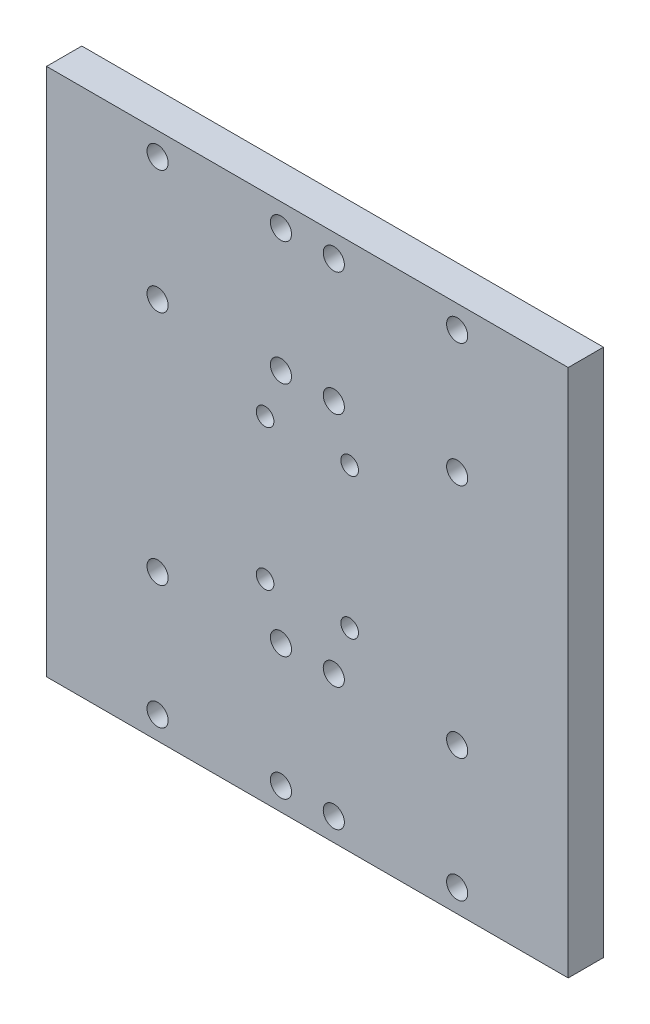
ISO-10303-21;
HEADER;
FILE_DESCRIPTION(('STEP AP214'),'2;1');
FILE_NAME('part.step','',(''),(''),'','','');
FILE_SCHEMA(('AUTOMOTIVE_DESIGN { 1 0 10303 214 1 1 1 1 }'));
ENDSEC;
DATA;
#1=APPLICATION_CONTEXT('core data for automotive mechanical design processes');
#2=APPLICATION_PROTOCOL_DEFINITION('international standard','automotive_design',2000,#1);
#3=PRODUCT_CONTEXT('',#1,'mechanical');
#4=PRODUCT('Part','Part','',(#3));
#5=PRODUCT_RELATED_PRODUCT_CATEGORY('part','',(#4));
#6=PRODUCT_DEFINITION_FORMATION('','',#4);
#7=PRODUCT_DEFINITION_CONTEXT('part definition',#1,'design');
#8=PRODUCT_DEFINITION('design','',#6,#7);
#9=PRODUCT_DEFINITION_SHAPE('','',#8);
#10=(LENGTH_UNIT() NAMED_UNIT(*) SI_UNIT(.MILLI.,.METRE.));
#11=(NAMED_UNIT(*) PLANE_ANGLE_UNIT() SI_UNIT($,.RADIAN.));
#12=(NAMED_UNIT(*) SI_UNIT($,.STERADIAN.) SOLID_ANGLE_UNIT());
#13=UNCERTAINTY_MEASURE_WITH_UNIT(LENGTH_MEASURE(1.E-05),#10,'distance_accuracy_value','');
#14=(GEOMETRIC_REPRESENTATION_CONTEXT(3) GLOBAL_UNCERTAINTY_ASSIGNED_CONTEXT((#13)) GLOBAL_UNIT_ASSIGNED_CONTEXT((#10,
#11,#12)) REPRESENTATION_CONTEXT('',''));
#15=CARTESIAN_POINT('',(0.,0.,0.));
#16=DIRECTION('',(0.,0.,1.));
#17=DIRECTION('',(1.,0.,0.));
#18=AXIS2_PLACEMENT_3D('',#15,#16,#17);
#19=CARTESIAN_POINT('',(-74.,-75.,10.));
#20=DIRECTION('',(1.,0.,0.));
#21=DIRECTION('',(0.,0.,-1.));
#22=AXIS2_PLACEMENT_3D('',#19,#20,#21);
#23=PLANE('',#22);
#24=DIRECTION('',(0.,-1.,0.));
#25=VECTOR('',#24,1.);
#26=CARTESIAN_POINT('',(-74.,-75.,0.));
#27=LINE('',#26,#25);
#28=CARTESIAN_POINT('',(-74.,75.,0.));
#29=VERTEX_POINT('',#28);
#30=CARTESIAN_POINT('',(-74.,-75.,0.));
#31=VERTEX_POINT('',#30);
#32=EDGE_CURVE('E95',#29,#31,#27,.T.);
#33=ORIENTED_EDGE('',*,*,#32,.T.);
#34=DIRECTION('',(0.,0.,-1.));
#35=VECTOR('',#34,1.);
#36=CARTESIAN_POINT('',(-74.,-75.,10.));
#37=LINE('',#36,#35);
#38=CARTESIAN_POINT('',(-74.,-75.,10.));
#39=VERTEX_POINT('',#38);
#40=EDGE_CURVE('E11',#39,#31,#37,.T.);
#41=ORIENTED_EDGE('',*,*,#40,.F.);
#42=DIRECTION('',(0.,-1.,0.));
#43=VECTOR('',#42,1.);
#44=CARTESIAN_POINT('',(-74.,-75.,10.));
#45=LINE('',#44,#43);
#46=CARTESIAN_POINT('',(-74.,75.,10.));
#47=VERTEX_POINT('',#46);
#48=EDGE_CURVE('E83',#47,#39,#45,.T.);
#49=ORIENTED_EDGE('',*,*,#48,.F.);
#50=DIRECTION('',(0.,0.,-1.));
#51=VECTOR('',#50,1.);
#52=CARTESIAN_POINT('',(-74.,75.,10.));
#53=LINE('',#52,#51);
#54=EDGE_CURVE('E91',#47,#29,#53,.T.);
#55=ORIENTED_EDGE('',*,*,#54,.T.);
#56=EDGE_LOOP('',(#33,#41,#49,#55));
#57=FACE_BOUND('',#56,.T.);
#58=ADVANCED_FACE('F32',(#57),#23,.F.);
#59=CARTESIAN_POINT('',(74.,-75.,10.));
#60=DIRECTION('',(0.,1.,0.));
#61=DIRECTION('',(0.,0.,1.));
#62=AXIS2_PLACEMENT_3D('',#59,#60,#61);
#63=PLANE('',#62);
#64=DIRECTION('',(1.,0.,0.));
#65=VECTOR('',#64,1.);
#66=CARTESIAN_POINT('',(74.,-75.,0.));
#67=LINE('',#66,#65);
#68=CARTESIAN_POINT('',(74.,-75.,0.));
#69=VERTEX_POINT('',#68);
#70=EDGE_CURVE('E87',#31,#69,#67,.T.);
#71=ORIENTED_EDGE('',*,*,#70,.T.);
#72=DIRECTION('',(0.,0.,-1.));
#73=VECTOR('',#72,1.);
#74=CARTESIAN_POINT('',(74.,-75.,10.));
#75=LINE('',#74,#73);
#76=CARTESIAN_POINT('',(74.,-75.,10.));
#77=VERTEX_POINT('',#76);
#78=EDGE_CURVE('E40',#77,#69,#75,.T.);
#79=ORIENTED_EDGE('',*,*,#78,.F.);
#80=DIRECTION('',(1.,0.,0.));
#81=VECTOR('',#80,1.);
#82=CARTESIAN_POINT('',(74.,-75.,10.));
#83=LINE('',#82,#81);
#84=EDGE_CURVE('E78',#39,#77,#83,.T.);
#85=ORIENTED_EDGE('',*,*,#84,.F.);
#86=ORIENTED_EDGE('',*,*,#40,.T.);
#87=EDGE_LOOP('',(#71,#79,#85,#86));
#88=FACE_BOUND('',#87,.T.);
#89=ADVANCED_FACE('F86',(#88),#63,.F.);
#90=CARTESIAN_POINT('',(74.,-75.,10.));
#91=DIRECTION('',(-1.,0.,0.));
#92=DIRECTION('',(0.,0.,1.));
#93=AXIS2_PLACEMENT_3D('',#90,#91,#92);
#94=PLANE('',#93);
#95=DIRECTION('',(0.,1.,0.));
#96=VECTOR('',#95,1.);
#97=CARTESIAN_POINT('',(74.,-75.,0.));
#98=LINE('',#97,#96);
#99=CARTESIAN_POINT('',(74.,75.,0.));
#100=VERTEX_POINT('',#99);
#101=EDGE_CURVE('E65',#69,#100,#98,.T.);
#102=ORIENTED_EDGE('',*,*,#101,.T.);
#103=DIRECTION('',(0.,0.,-1.));
#104=VECTOR('',#103,1.);
#105=CARTESIAN_POINT('',(74.,75.,10.));
#106=LINE('',#105,#104);
#107=CARTESIAN_POINT('',(74.,75.,10.));
#108=VERTEX_POINT('',#107);
#109=EDGE_CURVE('E88',#108,#100,#106,.T.);
#110=ORIENTED_EDGE('',*,*,#109,.F.);
#111=DIRECTION('',(0.,1.,0.));
#112=VECTOR('',#111,1.);
#113=CARTESIAN_POINT('',(74.,-75.,10.));
#114=LINE('',#113,#112);
#115=EDGE_CURVE('E81',#77,#108,#114,.T.);
#116=ORIENTED_EDGE('',*,*,#115,.F.);
#117=ORIENTED_EDGE('',*,*,#78,.T.);
#118=EDGE_LOOP('',(#102,#110,#116,#117));
#119=FACE_BOUND('',#118,.T.);
#120=ADVANCED_FACE('F89',(#119),#94,.F.);
#121=CARTESIAN_POINT('',(74.,75.,10.));
#122=DIRECTION('',(0.,-1.,0.));
#123=DIRECTION('',(0.,0.,-1.));
#124=AXIS2_PLACEMENT_3D('',#121,#122,#123);
#125=PLANE('',#124);
#126=DIRECTION('',(-1.,0.,0.));
#127=VECTOR('',#126,1.);
#128=CARTESIAN_POINT('',(74.,75.,0.));
#129=LINE('',#128,#127);
#130=EDGE_CURVE('E71',#100,#29,#129,.T.);
#131=ORIENTED_EDGE('',*,*,#130,.T.);
#132=ORIENTED_EDGE('',*,*,#54,.F.);
#133=DIRECTION('',(-1.,0.,0.));
#134=VECTOR('',#133,1.);
#135=CARTESIAN_POINT('',(74.,75.,10.));
#136=LINE('',#135,#134);
#137=EDGE_CURVE('E48',#108,#47,#136,.T.);
#138=ORIENTED_EDGE('',*,*,#137,.F.);
#139=ORIENTED_EDGE('',*,*,#109,.T.);
#140=EDGE_LOOP('',(#131,#132,#138,#139));
#141=FACE_BOUND('',#140,.T.);
#142=ADVANCED_FACE('F103',(#141),#125,.F.);
#143=CARTESIAN_POINT('',(0.,0.,10.));
#144=DIRECTION('',(0.,0.,1.));
#145=DIRECTION('',(1.,0.,0.));
#146=AXIS2_PLACEMENT_3D('',#143,#144,#145);
#147=PLANE('',#146);
#148=CARTESIAN_POINT('',(-42.5,-68.5,10.));
#149=DIRECTION('',(0.,0.,1.));
#150=DIRECTION('',(-1.,0.,0.));
#151=AXIS2_PLACEMENT_3D('',#148,#149,#150);
#152=CIRCLE('',#151,3.);
#153=CARTESIAN_POINT('',(-45.5,-68.5,10.));
#154=VERTEX_POINT('',#153);
#155=EDGE_CURVE('E223',#154,#154,#152,.T.);
#156=ORIENTED_EDGE('',*,*,#155,.F.);
#157=EDGE_LOOP('',(#156));
#158=FACE_BOUND('',#157,.T.);
#159=CARTESIAN_POINT('',(-42.5,-33.5,10.));
#160=DIRECTION('',(0.,0.,1.));
#161=DIRECTION('',(-1.,0.,0.));
#162=AXIS2_PLACEMENT_3D('',#159,#160,#161);
#163=CIRCLE('',#162,3.);
#164=CARTESIAN_POINT('',(-45.5,-33.5,10.));
#165=VERTEX_POINT('',#164);
#166=EDGE_CURVE('E217',#165,#165,#163,.T.);
#167=ORIENTED_EDGE('',*,*,#166,.F.);
#168=EDGE_LOOP('',(#167));
#169=FACE_BOUND('',#168,.T.);
#170=CARTESIAN_POINT('',(42.5,-33.5,10.));
#171=DIRECTION('',(0.,0.,1.));
#172=DIRECTION('',(-1.,0.,0.));
#173=AXIS2_PLACEMENT_3D('',#170,#171,#172);
#174=CIRCLE('',#173,3.);
#175=CARTESIAN_POINT('',(39.5,-33.5,10.));
#176=VERTEX_POINT('',#175);
#177=EDGE_CURVE('E211',#176,#176,#174,.T.);
#178=ORIENTED_EDGE('',*,*,#177,.F.);
#179=EDGE_LOOP('',(#178));
#180=FACE_BOUND('',#179,.T.);
#181=CARTESIAN_POINT('',(42.5,-68.5,10.));
#182=DIRECTION('',(0.,0.,1.));
#183=DIRECTION('',(-1.,0.,0.));
#184=AXIS2_PLACEMENT_3D('',#181,#182,#183);
#185=CIRCLE('',#184,3.);
#186=CARTESIAN_POINT('',(39.5,-68.5,10.));
#187=VERTEX_POINT('',#186);
#188=EDGE_CURVE('E205',#187,#187,#185,.T.);
#189=ORIENTED_EDGE('',*,*,#188,.F.);
#190=EDGE_LOOP('',(#189));
#191=FACE_BOUND('',#190,.T.);
#192=CARTESIAN_POINT('',(-7.49999999999998,-68.5,10.));
#193=DIRECTION('',(0.,0.,1.));
#194=DIRECTION('',(-1.,0.,0.));
#195=AXIS2_PLACEMENT_3D('',#192,#193,#194);
#196=CIRCLE('',#195,3.);
#197=CARTESIAN_POINT('',(-10.5,-68.5,10.));
#198=VERTEX_POINT('',#197);
#199=EDGE_CURVE('E199',#198,#198,#196,.T.);
#200=ORIENTED_EDGE('',*,*,#199,.F.);
#201=EDGE_LOOP('',(#200));
#202=FACE_BOUND('',#201,.T.);
#203=CARTESIAN_POINT('',(7.50000000000002,-68.5,10.));
#204=DIRECTION('',(0.,0.,1.));
#205=DIRECTION('',(-1.,0.,0.));
#206=AXIS2_PLACEMENT_3D('',#203,#204,#205);
#207=CIRCLE('',#206,3.);
#208=CARTESIAN_POINT('',(4.50000000000001,-68.5,10.));
#209=VERTEX_POINT('',#208);
#210=EDGE_CURVE('E193',#209,#209,#207,.T.);
#211=ORIENTED_EDGE('',*,*,#210,.F.);
#212=EDGE_LOOP('',(#211));
#213=FACE_BOUND('',#212,.T.);
#214=CARTESIAN_POINT('',(-7.49999999999999,-33.5,10.));
#215=DIRECTION('',(0.,0.,1.));
#216=DIRECTION('',(-1.,0.,0.));
#217=AXIS2_PLACEMENT_3D('',#214,#215,#216);
#218=CIRCLE('',#217,3.);
#219=CARTESIAN_POINT('',(-10.5,-33.5,10.));
#220=VERTEX_POINT('',#219);
#221=EDGE_CURVE('E187',#220,#220,#218,.T.);
#222=ORIENTED_EDGE('',*,*,#221,.F.);
#223=EDGE_LOOP('',(#222));
#224=FACE_BOUND('',#223,.T.);
#225=CARTESIAN_POINT('',(7.50000000000001,-33.5,10.));
#226=DIRECTION('',(0.,0.,1.));
#227=DIRECTION('',(-1.,0.,0.));
#228=AXIS2_PLACEMENT_3D('',#225,#226,#227);
#229=CIRCLE('',#228,3.);
#230=CARTESIAN_POINT('',(4.5,-33.5,10.));
#231=VERTEX_POINT('',#230);
#232=EDGE_CURVE('E181',#231,#231,#229,.T.);
#233=ORIENTED_EDGE('',*,*,#232,.F.);
#234=EDGE_LOOP('',(#233));
#235=FACE_BOUND('',#234,.T.);
#236=CARTESIAN_POINT('',(-12.,-20.,10.));
#237=DIRECTION('',(0.,0.,1.));
#238=DIRECTION('',(-1.,0.,0.));
#239=AXIS2_PLACEMENT_3D('',#236,#237,#238);
#240=CIRCLE('',#239,2.5);
#241=CARTESIAN_POINT('',(-14.5,-20.,10.));
#242=VERTEX_POINT('',#241);
#243=EDGE_CURVE('E175',#242,#242,#240,.T.);
#244=ORIENTED_EDGE('',*,*,#243,.F.);
#245=EDGE_LOOP('',(#244));
#246=FACE_BOUND('',#245,.T.);
#247=CARTESIAN_POINT('',(12.,-20.,10.));
#248=DIRECTION('',(0.,0.,1.));
#249=DIRECTION('',(-1.,0.,0.));
#250=AXIS2_PLACEMENT_3D('',#247,#248,#249);
#251=CIRCLE('',#250,2.5);
#252=CARTESIAN_POINT('',(9.5,-20.,10.));
#253=VERTEX_POINT('',#252);
#254=EDGE_CURVE('E169',#253,#253,#251,.T.);
#255=ORIENTED_EDGE('',*,*,#254,.F.);
#256=EDGE_LOOP('',(#255));
#257=FACE_BOUND('',#256,.T.);
#258=CARTESIAN_POINT('',(12.,20.,10.));
#259=DIRECTION('',(0.,0.,1.));
#260=DIRECTION('',(1.,0.,0.));
#261=AXIS2_PLACEMENT_3D('',#258,#259,#260);
#262=CIRCLE('',#261,2.5);
#263=CARTESIAN_POINT('',(14.5,20.,10.));
#264=VERTEX_POINT('',#263);
#265=EDGE_CURVE('E163',#264,#264,#262,.T.);
#266=ORIENTED_EDGE('',*,*,#265,.F.);
#267=EDGE_LOOP('',(#266));
#268=FACE_BOUND('',#267,.T.);
#269=CARTESIAN_POINT('',(-12.,20.,10.));
#270=DIRECTION('',(0.,0.,1.));
#271=DIRECTION('',(1.,0.,0.));
#272=AXIS2_PLACEMENT_3D('',#269,#270,#271);
#273=CIRCLE('',#272,2.5);
#274=CARTESIAN_POINT('',(-9.5,20.,10.));
#275=VERTEX_POINT('',#274);
#276=EDGE_CURVE('E157',#275,#275,#273,.T.);
#277=ORIENTED_EDGE('',*,*,#276,.F.);
#278=EDGE_LOOP('',(#277));
#279=FACE_BOUND('',#278,.T.);
#280=CARTESIAN_POINT('',(7.5,33.5,10.));
#281=DIRECTION('',(0.,0.,1.));
#282=DIRECTION('',(1.,0.,0.));
#283=AXIS2_PLACEMENT_3D('',#280,#281,#282);
#284=CIRCLE('',#283,3.);
#285=CARTESIAN_POINT('',(10.5,33.5,10.));
#286=VERTEX_POINT('',#285);
#287=EDGE_CURVE('E151',#286,#286,#284,.T.);
#288=ORIENTED_EDGE('',*,*,#287,.F.);
#289=EDGE_LOOP('',(#288));
#290=FACE_BOUND('',#289,.T.);
#291=CARTESIAN_POINT('',(-7.5,33.5,10.));
#292=DIRECTION('',(0.,0.,1.));
#293=DIRECTION('',(1.,0.,0.));
#294=AXIS2_PLACEMENT_3D('',#291,#292,#293);
#295=CIRCLE('',#294,3.);
#296=CARTESIAN_POINT('',(-4.5,33.5,10.));
#297=VERTEX_POINT('',#296);
#298=EDGE_CURVE('E145',#297,#297,#295,.T.);
#299=ORIENTED_EDGE('',*,*,#298,.F.);
#300=EDGE_LOOP('',(#299));
#301=FACE_BOUND('',#300,.T.);
#302=CARTESIAN_POINT('',(7.5,68.5,10.));
#303=DIRECTION('',(0.,0.,1.));
#304=DIRECTION('',(1.,0.,0.));
#305=AXIS2_PLACEMENT_3D('',#302,#303,#304);
#306=CIRCLE('',#305,3.);
#307=CARTESIAN_POINT('',(10.5,68.5,10.));
#308=VERTEX_POINT('',#307);
#309=EDGE_CURVE('E139',#308,#308,#306,.T.);
#310=ORIENTED_EDGE('',*,*,#309,.F.);
#311=EDGE_LOOP('',(#310));
#312=FACE_BOUND('',#311,.T.);
#313=CARTESIAN_POINT('',(-7.5,68.5,10.));
#314=DIRECTION('',(0.,0.,1.));
#315=DIRECTION('',(1.,0.,0.));
#316=AXIS2_PLACEMENT_3D('',#313,#314,#315);
#317=CIRCLE('',#316,3.);
#318=CARTESIAN_POINT('',(-4.5,68.5,10.));
#319=VERTEX_POINT('',#318);
#320=EDGE_CURVE('E133',#319,#319,#317,.T.);
#321=ORIENTED_EDGE('',*,*,#320,.F.);
#322=EDGE_LOOP('',(#321));
#323=FACE_BOUND('',#322,.T.);
#324=CARTESIAN_POINT('',(42.5,68.5,10.));
#325=DIRECTION('',(0.,0.,1.));
#326=DIRECTION('',(1.,0.,0.));
#327=AXIS2_PLACEMENT_3D('',#324,#325,#326);
#328=CIRCLE('',#327,3.);
#329=CARTESIAN_POINT('',(45.5,68.5,10.));
#330=VERTEX_POINT('',#329);
#331=EDGE_CURVE('E127',#330,#330,#328,.T.);
#332=ORIENTED_EDGE('',*,*,#331,.F.);
#333=EDGE_LOOP('',(#332));
#334=FACE_BOUND('',#333,.T.);
#335=CARTESIAN_POINT('',(42.5,33.5,10.));
#336=DIRECTION('',(0.,0.,1.));
#337=DIRECTION('',(1.,0.,0.));
#338=AXIS2_PLACEMENT_3D('',#335,#336,#337);
#339=CIRCLE('',#338,3.);
#340=CARTESIAN_POINT('',(45.5,33.5,10.));
#341=VERTEX_POINT('',#340);
#342=EDGE_CURVE('E121',#341,#341,#339,.T.);
#343=ORIENTED_EDGE('',*,*,#342,.F.);
#344=EDGE_LOOP('',(#343));
#345=FACE_BOUND('',#344,.T.);
#346=CARTESIAN_POINT('',(-42.5,33.5,10.));
#347=DIRECTION('',(0.,0.,1.));
#348=DIRECTION('',(1.,0.,0.));
#349=AXIS2_PLACEMENT_3D('',#346,#347,#348);
#350=CIRCLE('',#349,3.);
#351=CARTESIAN_POINT('',(-39.5,33.5,10.));
#352=VERTEX_POINT('',#351);
#353=EDGE_CURVE('E115',#352,#352,#350,.T.);
#354=ORIENTED_EDGE('',*,*,#353,.F.);
#355=EDGE_LOOP('',(#354));
#356=FACE_BOUND('',#355,.T.);
#357=CARTESIAN_POINT('',(-42.5,68.5,10.));
#358=DIRECTION('',(0.,0.,1.));
#359=DIRECTION('',(1.,0.,0.));
#360=AXIS2_PLACEMENT_3D('',#357,#358,#359);
#361=CIRCLE('',#360,3.);
#362=CARTESIAN_POINT('',(-39.5,68.5,10.));
#363=VERTEX_POINT('',#362);
#364=EDGE_CURVE('E109',#363,#363,#361,.T.);
#365=ORIENTED_EDGE('',*,*,#364,.F.);
#366=EDGE_LOOP('',(#365));
#367=FACE_BOUND('',#366,.T.);
#368=ORIENTED_EDGE('',*,*,#48,.T.);
#369=ORIENTED_EDGE('',*,*,#84,.T.);
#370=ORIENTED_EDGE('',*,*,#115,.T.);
#371=ORIENTED_EDGE('',*,*,#137,.T.);
#372=EDGE_LOOP('',(#368,#369,#370,#371));
#373=FACE_BOUND('',#372,.T.);
#374=ADVANCED_FACE('F79',(#158,#169,#180,#191,#202,#213,#224,#235,#246,#257,#268,#279,#290,#301,
#312,#323,#334,#345,#356,#367,#373),#147,.T.);
#375=CARTESIAN_POINT('',(0.,0.,0.));
#376=DIRECTION('',(0.,0.,1.));
#377=DIRECTION('',(1.,0.,0.));
#378=AXIS2_PLACEMENT_3D('',#375,#376,#377);
#379=PLANE('',#378);
#380=CARTESIAN_POINT('',(-42.5,-68.5,0.));
#381=DIRECTION('',(0.,0.,1.));
#382=DIRECTION('',(-1.,0.,0.));
#383=AXIS2_PLACEMENT_3D('',#380,#381,#382);
#384=CIRCLE('',#383,3.);
#385=CARTESIAN_POINT('',(-45.5,-68.5,0.));
#386=VERTEX_POINT('',#385);
#387=EDGE_CURVE('E220',#386,#386,#384,.T.);
#388=ORIENTED_EDGE('',*,*,#387,.T.);
#389=EDGE_LOOP('',(#388));
#390=FACE_BOUND('',#389,.T.);
#391=CARTESIAN_POINT('',(-42.5,-33.5,0.));
#392=DIRECTION('',(0.,0.,1.));
#393=DIRECTION('',(-1.,0.,0.));
#394=AXIS2_PLACEMENT_3D('',#391,#392,#393);
#395=CIRCLE('',#394,3.);
#396=CARTESIAN_POINT('',(-45.5,-33.5,0.));
#397=VERTEX_POINT('',#396);
#398=EDGE_CURVE('E214',#397,#397,#395,.T.);
#399=ORIENTED_EDGE('',*,*,#398,.T.);
#400=EDGE_LOOP('',(#399));
#401=FACE_BOUND('',#400,.T.);
#402=CARTESIAN_POINT('',(42.5,-33.5,0.));
#403=DIRECTION('',(0.,0.,1.));
#404=DIRECTION('',(-1.,0.,0.));
#405=AXIS2_PLACEMENT_3D('',#402,#403,#404);
#406=CIRCLE('',#405,3.);
#407=CARTESIAN_POINT('',(39.5,-33.5,0.));
#408=VERTEX_POINT('',#407);
#409=EDGE_CURVE('E208',#408,#408,#406,.T.);
#410=ORIENTED_EDGE('',*,*,#409,.T.);
#411=EDGE_LOOP('',(#410));
#412=FACE_BOUND('',#411,.T.);
#413=CARTESIAN_POINT('',(42.5,-68.5,0.));
#414=DIRECTION('',(0.,0.,1.));
#415=DIRECTION('',(-1.,0.,0.));
#416=AXIS2_PLACEMENT_3D('',#413,#414,#415);
#417=CIRCLE('',#416,3.);
#418=CARTESIAN_POINT('',(39.5,-68.5,0.));
#419=VERTEX_POINT('',#418);
#420=EDGE_CURVE('E202',#419,#419,#417,.T.);
#421=ORIENTED_EDGE('',*,*,#420,.T.);
#422=EDGE_LOOP('',(#421));
#423=FACE_BOUND('',#422,.T.);
#424=CARTESIAN_POINT('',(-7.49999999999998,-68.5,0.));
#425=DIRECTION('',(0.,0.,1.));
#426=DIRECTION('',(-1.,0.,0.));
#427=AXIS2_PLACEMENT_3D('',#424,#425,#426);
#428=CIRCLE('',#427,3.);
#429=CARTESIAN_POINT('',(-10.5,-68.5,0.));
#430=VERTEX_POINT('',#429);
#431=EDGE_CURVE('E196',#430,#430,#428,.T.);
#432=ORIENTED_EDGE('',*,*,#431,.T.);
#433=EDGE_LOOP('',(#432));
#434=FACE_BOUND('',#433,.T.);
#435=CARTESIAN_POINT('',(7.50000000000002,-68.5,0.));
#436=DIRECTION('',(0.,0.,1.));
#437=DIRECTION('',(-1.,0.,0.));
#438=AXIS2_PLACEMENT_3D('',#435,#436,#437);
#439=CIRCLE('',#438,3.);
#440=CARTESIAN_POINT('',(4.50000000000001,-68.5,0.));
#441=VERTEX_POINT('',#440);
#442=EDGE_CURVE('E190',#441,#441,#439,.T.);
#443=ORIENTED_EDGE('',*,*,#442,.T.);
#444=EDGE_LOOP('',(#443));
#445=FACE_BOUND('',#444,.T.);
#446=CARTESIAN_POINT('',(-7.49999999999999,-33.5,0.));
#447=DIRECTION('',(0.,0.,1.));
#448=DIRECTION('',(-1.,0.,0.));
#449=AXIS2_PLACEMENT_3D('',#446,#447,#448);
#450=CIRCLE('',#449,3.);
#451=CARTESIAN_POINT('',(-10.5,-33.5,0.));
#452=VERTEX_POINT('',#451);
#453=EDGE_CURVE('E184',#452,#452,#450,.T.);
#454=ORIENTED_EDGE('',*,*,#453,.T.);
#455=EDGE_LOOP('',(#454));
#456=FACE_BOUND('',#455,.T.);
#457=CARTESIAN_POINT('',(7.50000000000001,-33.5,0.));
#458=DIRECTION('',(0.,0.,1.));
#459=DIRECTION('',(-1.,0.,0.));
#460=AXIS2_PLACEMENT_3D('',#457,#458,#459);
#461=CIRCLE('',#460,3.);
#462=CARTESIAN_POINT('',(4.5,-33.5,0.));
#463=VERTEX_POINT('',#462);
#464=EDGE_CURVE('E178',#463,#463,#461,.T.);
#465=ORIENTED_EDGE('',*,*,#464,.T.);
#466=EDGE_LOOP('',(#465));
#467=FACE_BOUND('',#466,.T.);
#468=CARTESIAN_POINT('',(-12.,-20.,0.));
#469=DIRECTION('',(0.,0.,1.));
#470=DIRECTION('',(-1.,0.,0.));
#471=AXIS2_PLACEMENT_3D('',#468,#469,#470);
#472=CIRCLE('',#471,2.5);
#473=CARTESIAN_POINT('',(-14.5,-20.,0.));
#474=VERTEX_POINT('',#473);
#475=EDGE_CURVE('E172',#474,#474,#472,.T.);
#476=ORIENTED_EDGE('',*,*,#475,.T.);
#477=EDGE_LOOP('',(#476));
#478=FACE_BOUND('',#477,.T.);
#479=CARTESIAN_POINT('',(12.,-20.,0.));
#480=DIRECTION('',(0.,0.,1.));
#481=DIRECTION('',(-1.,0.,0.));
#482=AXIS2_PLACEMENT_3D('',#479,#480,#481);
#483=CIRCLE('',#482,2.5);
#484=CARTESIAN_POINT('',(9.5,-20.,0.));
#485=VERTEX_POINT('',#484);
#486=EDGE_CURVE('E166',#485,#485,#483,.T.);
#487=ORIENTED_EDGE('',*,*,#486,.T.);
#488=EDGE_LOOP('',(#487));
#489=FACE_BOUND('',#488,.T.);
#490=CARTESIAN_POINT('',(12.,20.,0.));
#491=DIRECTION('',(0.,0.,1.));
#492=DIRECTION('',(1.,0.,0.));
#493=AXIS2_PLACEMENT_3D('',#490,#491,#492);
#494=CIRCLE('',#493,2.5);
#495=CARTESIAN_POINT('',(14.5,20.,0.));
#496=VERTEX_POINT('',#495);
#497=EDGE_CURVE('E160',#496,#496,#494,.T.);
#498=ORIENTED_EDGE('',*,*,#497,.T.);
#499=EDGE_LOOP('',(#498));
#500=FACE_BOUND('',#499,.T.);
#501=CARTESIAN_POINT('',(-12.,20.,0.));
#502=DIRECTION('',(0.,0.,1.));
#503=DIRECTION('',(1.,0.,0.));
#504=AXIS2_PLACEMENT_3D('',#501,#502,#503);
#505=CIRCLE('',#504,2.5);
#506=CARTESIAN_POINT('',(-9.5,20.,0.));
#507=VERTEX_POINT('',#506);
#508=EDGE_CURVE('E154',#507,#507,#505,.T.);
#509=ORIENTED_EDGE('',*,*,#508,.T.);
#510=EDGE_LOOP('',(#509));
#511=FACE_BOUND('',#510,.T.);
#512=CARTESIAN_POINT('',(7.5,33.5,0.));
#513=DIRECTION('',(0.,0.,1.));
#514=DIRECTION('',(1.,0.,0.));
#515=AXIS2_PLACEMENT_3D('',#512,#513,#514);
#516=CIRCLE('',#515,3.);
#517=CARTESIAN_POINT('',(10.5,33.5,0.));
#518=VERTEX_POINT('',#517);
#519=EDGE_CURVE('E148',#518,#518,#516,.T.);
#520=ORIENTED_EDGE('',*,*,#519,.T.);
#521=EDGE_LOOP('',(#520));
#522=FACE_BOUND('',#521,.T.);
#523=CARTESIAN_POINT('',(-7.5,33.5,0.));
#524=DIRECTION('',(0.,0.,1.));
#525=DIRECTION('',(1.,0.,0.));
#526=AXIS2_PLACEMENT_3D('',#523,#524,#525);
#527=CIRCLE('',#526,3.);
#528=CARTESIAN_POINT('',(-4.5,33.5,0.));
#529=VERTEX_POINT('',#528);
#530=EDGE_CURVE('E142',#529,#529,#527,.T.);
#531=ORIENTED_EDGE('',*,*,#530,.T.);
#532=EDGE_LOOP('',(#531));
#533=FACE_BOUND('',#532,.T.);
#534=CARTESIAN_POINT('',(7.5,68.5,0.));
#535=DIRECTION('',(0.,0.,1.));
#536=DIRECTION('',(1.,0.,0.));
#537=AXIS2_PLACEMENT_3D('',#534,#535,#536);
#538=CIRCLE('',#537,3.);
#539=CARTESIAN_POINT('',(10.5,68.5,0.));
#540=VERTEX_POINT('',#539);
#541=EDGE_CURVE('E136',#540,#540,#538,.T.);
#542=ORIENTED_EDGE('',*,*,#541,.T.);
#543=EDGE_LOOP('',(#542));
#544=FACE_BOUND('',#543,.T.);
#545=CARTESIAN_POINT('',(-7.5,68.5,0.));
#546=DIRECTION('',(0.,0.,1.));
#547=DIRECTION('',(1.,0.,0.));
#548=AXIS2_PLACEMENT_3D('',#545,#546,#547);
#549=CIRCLE('',#548,3.);
#550=CARTESIAN_POINT('',(-4.5,68.5,0.));
#551=VERTEX_POINT('',#550);
#552=EDGE_CURVE('E130',#551,#551,#549,.T.);
#553=ORIENTED_EDGE('',*,*,#552,.T.);
#554=EDGE_LOOP('',(#553));
#555=FACE_BOUND('',#554,.T.);
#556=CARTESIAN_POINT('',(42.5,68.5,0.));
#557=DIRECTION('',(0.,0.,1.));
#558=DIRECTION('',(1.,0.,0.));
#559=AXIS2_PLACEMENT_3D('',#556,#557,#558);
#560=CIRCLE('',#559,3.);
#561=CARTESIAN_POINT('',(45.5,68.5,0.));
#562=VERTEX_POINT('',#561);
#563=EDGE_CURVE('E124',#562,#562,#560,.T.);
#564=ORIENTED_EDGE('',*,*,#563,.T.);
#565=EDGE_LOOP('',(#564));
#566=FACE_BOUND('',#565,.T.);
#567=CARTESIAN_POINT('',(42.5,33.5,0.));
#568=DIRECTION('',(0.,0.,1.));
#569=DIRECTION('',(1.,0.,0.));
#570=AXIS2_PLACEMENT_3D('',#567,#568,#569);
#571=CIRCLE('',#570,3.);
#572=CARTESIAN_POINT('',(45.5,33.5,0.));
#573=VERTEX_POINT('',#572);
#574=EDGE_CURVE('E118',#573,#573,#571,.T.);
#575=ORIENTED_EDGE('',*,*,#574,.T.);
#576=EDGE_LOOP('',(#575));
#577=FACE_BOUND('',#576,.T.);
#578=CARTESIAN_POINT('',(-42.5,33.5,0.));
#579=DIRECTION('',(0.,0.,1.));
#580=DIRECTION('',(1.,0.,0.));
#581=AXIS2_PLACEMENT_3D('',#578,#579,#580);
#582=CIRCLE('',#581,3.);
#583=CARTESIAN_POINT('',(-39.5,33.5,0.));
#584=VERTEX_POINT('',#583);
#585=EDGE_CURVE('E112',#584,#584,#582,.T.);
#586=ORIENTED_EDGE('',*,*,#585,.T.);
#587=EDGE_LOOP('',(#586));
#588=FACE_BOUND('',#587,.T.);
#589=CARTESIAN_POINT('',(-42.5,68.5,0.));
#590=DIRECTION('',(0.,0.,1.));
#591=DIRECTION('',(1.,0.,0.));
#592=AXIS2_PLACEMENT_3D('',#589,#590,#591);
#593=CIRCLE('',#592,3.);
#594=CARTESIAN_POINT('',(-39.5,68.5,0.));
#595=VERTEX_POINT('',#594);
#596=EDGE_CURVE('E98',#595,#595,#593,.T.);
#597=ORIENTED_EDGE('',*,*,#596,.T.);
#598=EDGE_LOOP('',(#597));
#599=FACE_BOUND('',#598,.T.);
#600=ORIENTED_EDGE('',*,*,#32,.F.);
#601=ORIENTED_EDGE('',*,*,#130,.F.);
#602=ORIENTED_EDGE('',*,*,#101,.F.);
#603=ORIENTED_EDGE('',*,*,#70,.F.);
#604=EDGE_LOOP('',(#600,#601,#602,#603));
#605=FACE_BOUND('',#604,.T.);
#606=ADVANCED_FACE('F106',(#390,#401,#412,#423,#434,#445,#456,#467,#478,#489,#500,#511,#522,
#533,#544,#555,#566,#577,#588,#599,#605),#379,.F.);
#607=CARTESIAN_POINT('',(-42.5,68.5,0.));
#608=DIRECTION('',(0.,0.,1.));
#609=DIRECTION('',(1.,0.,0.));
#610=AXIS2_PLACEMENT_3D('',#607,#608,#609);
#611=CYLINDRICAL_SURFACE('',#610,3.);
#612=ORIENTED_EDGE('',*,*,#596,.F.);
#613=EDGE_LOOP('',(#612));
#614=FACE_BOUND('',#613,.T.);
#615=ORIENTED_EDGE('',*,*,#364,.T.);
#616=EDGE_LOOP('',(#615));
#617=FACE_BOUND('',#616,.T.);
#618=ADVANCED_FACE('F279',(#614,#617),#611,.F.);
#619=CARTESIAN_POINT('',(-42.5,33.5,0.));
#620=DIRECTION('',(0.,0.,1.));
#621=DIRECTION('',(1.,0.,0.));
#622=AXIS2_PLACEMENT_3D('',#619,#620,#621);
#623=CYLINDRICAL_SURFACE('',#622,3.);
#624=ORIENTED_EDGE('',*,*,#585,.F.);
#625=EDGE_LOOP('',(#624));
#626=FACE_BOUND('',#625,.T.);
#627=ORIENTED_EDGE('',*,*,#353,.T.);
#628=EDGE_LOOP('',(#627));
#629=FACE_BOUND('',#628,.T.);
#630=ADVANCED_FACE('F281',(#626,#629),#623,.F.);
#631=CARTESIAN_POINT('',(42.5,33.5,0.));
#632=DIRECTION('',(0.,0.,1.));
#633=DIRECTION('',(1.,0.,0.));
#634=AXIS2_PLACEMENT_3D('',#631,#632,#633);
#635=CYLINDRICAL_SURFACE('',#634,3.);
#636=ORIENTED_EDGE('',*,*,#574,.F.);
#637=EDGE_LOOP('',(#636));
#638=FACE_BOUND('',#637,.T.);
#639=ORIENTED_EDGE('',*,*,#342,.T.);
#640=EDGE_LOOP('',(#639));
#641=FACE_BOUND('',#640,.T.);
#642=ADVANCED_FACE('F288',(#638,#641),#635,.F.);
#643=CARTESIAN_POINT('',(42.5,68.5,0.));
#644=DIRECTION('',(0.,0.,1.));
#645=DIRECTION('',(1.,0.,0.));
#646=AXIS2_PLACEMENT_3D('',#643,#644,#645);
#647=CYLINDRICAL_SURFACE('',#646,3.);
#648=ORIENTED_EDGE('',*,*,#563,.F.);
#649=EDGE_LOOP('',(#648));
#650=FACE_BOUND('',#649,.T.);
#651=ORIENTED_EDGE('',*,*,#331,.T.);
#652=EDGE_LOOP('',(#651));
#653=FACE_BOUND('',#652,.T.);
#654=ADVANCED_FACE('F334',(#650,#653),#647,.F.);
#655=CARTESIAN_POINT('',(-7.5,68.5,0.));
#656=DIRECTION('',(0.,0.,1.));
#657=DIRECTION('',(1.,0.,0.));
#658=AXIS2_PLACEMENT_3D('',#655,#656,#657);
#659=CYLINDRICAL_SURFACE('',#658,3.);
#660=ORIENTED_EDGE('',*,*,#552,.F.);
#661=EDGE_LOOP('',(#660));
#662=FACE_BOUND('',#661,.T.);
#663=ORIENTED_EDGE('',*,*,#320,.T.);
#664=EDGE_LOOP('',(#663));
#665=FACE_BOUND('',#664,.T.);
#666=ADVANCED_FACE('F344',(#662,#665),#659,.F.);
#667=CARTESIAN_POINT('',(7.5,68.5,0.));
#668=DIRECTION('',(0.,0.,1.));
#669=DIRECTION('',(1.,0.,0.));
#670=AXIS2_PLACEMENT_3D('',#667,#668,#669);
#671=CYLINDRICAL_SURFACE('',#670,3.);
#672=ORIENTED_EDGE('',*,*,#541,.F.);
#673=EDGE_LOOP('',(#672));
#674=FACE_BOUND('',#673,.T.);
#675=ORIENTED_EDGE('',*,*,#309,.T.);
#676=EDGE_LOOP('',(#675));
#677=FACE_BOUND('',#676,.T.);
#678=ADVANCED_FACE('F354',(#674,#677),#671,.F.);
#679=CARTESIAN_POINT('',(-7.5,33.5,0.));
#680=DIRECTION('',(0.,0.,1.));
#681=DIRECTION('',(1.,0.,0.));
#682=AXIS2_PLACEMENT_3D('',#679,#680,#681);
#683=CYLINDRICAL_SURFACE('',#682,3.);
#684=ORIENTED_EDGE('',*,*,#530,.F.);
#685=EDGE_LOOP('',(#684));
#686=FACE_BOUND('',#685,.T.);
#687=ORIENTED_EDGE('',*,*,#298,.T.);
#688=EDGE_LOOP('',(#687));
#689=FACE_BOUND('',#688,.T.);
#690=ADVANCED_FACE('F364',(#686,#689),#683,.F.);
#691=CARTESIAN_POINT('',(7.5,33.5,0.));
#692=DIRECTION('',(0.,0.,1.));
#693=DIRECTION('',(1.,0.,0.));
#694=AXIS2_PLACEMENT_3D('',#691,#692,#693);
#695=CYLINDRICAL_SURFACE('',#694,3.);
#696=ORIENTED_EDGE('',*,*,#519,.F.);
#697=EDGE_LOOP('',(#696));
#698=FACE_BOUND('',#697,.T.);
#699=ORIENTED_EDGE('',*,*,#287,.T.);
#700=EDGE_LOOP('',(#699));
#701=FACE_BOUND('',#700,.T.);
#702=ADVANCED_FACE('F374',(#698,#701),#695,.F.);
#703=CARTESIAN_POINT('',(-12.,20.,0.));
#704=DIRECTION('',(0.,0.,1.));
#705=DIRECTION('',(1.,0.,0.));
#706=AXIS2_PLACEMENT_3D('',#703,#704,#705);
#707=CYLINDRICAL_SURFACE('',#706,2.5);
#708=ORIENTED_EDGE('',*,*,#508,.F.);
#709=EDGE_LOOP('',(#708));
#710=FACE_BOUND('',#709,.T.);
#711=ORIENTED_EDGE('',*,*,#276,.T.);
#712=EDGE_LOOP('',(#711));
#713=FACE_BOUND('',#712,.T.);
#714=ADVANCED_FACE('F384',(#710,#713),#707,.F.);
#715=CARTESIAN_POINT('',(12.,20.,0.));
#716=DIRECTION('',(0.,0.,1.));
#717=DIRECTION('',(1.,0.,0.));
#718=AXIS2_PLACEMENT_3D('',#715,#716,#717);
#719=CYLINDRICAL_SURFACE('',#718,2.5);
#720=ORIENTED_EDGE('',*,*,#497,.F.);
#721=EDGE_LOOP('',(#720));
#722=FACE_BOUND('',#721,.T.);
#723=ORIENTED_EDGE('',*,*,#265,.T.);
#724=EDGE_LOOP('',(#723));
#725=FACE_BOUND('',#724,.T.);
#726=ADVANCED_FACE('F394',(#722,#725),#719,.F.);
#727=CARTESIAN_POINT('',(12.,-20.,0.));
#728=DIRECTION('',(0.,0.,1.));
#729=DIRECTION('',(1.,0.,0.));
#730=AXIS2_PLACEMENT_3D('',#727,#728,#729);
#731=CYLINDRICAL_SURFACE('',#730,2.5);
#732=ORIENTED_EDGE('',*,*,#486,.F.);
#733=EDGE_LOOP('',(#732));
#734=FACE_BOUND('',#733,.T.);
#735=ORIENTED_EDGE('',*,*,#254,.T.);
#736=EDGE_LOOP('',(#735));
#737=FACE_BOUND('',#736,.T.);
#738=ADVANCED_FACE('F404',(#734,#737),#731,.F.);
#739=CARTESIAN_POINT('',(-12.,-20.,0.));
#740=DIRECTION('',(0.,0.,1.));
#741=DIRECTION('',(1.,0.,0.));
#742=AXIS2_PLACEMENT_3D('',#739,#740,#741);
#743=CYLINDRICAL_SURFACE('',#742,2.5);
#744=ORIENTED_EDGE('',*,*,#475,.F.);
#745=EDGE_LOOP('',(#744));
#746=FACE_BOUND('',#745,.T.);
#747=ORIENTED_EDGE('',*,*,#243,.T.);
#748=EDGE_LOOP('',(#747));
#749=FACE_BOUND('',#748,.T.);
#750=ADVANCED_FACE('F414',(#746,#749),#743,.F.);
#751=CARTESIAN_POINT('',(7.50000000000001,-33.5,0.));
#752=DIRECTION('',(0.,0.,1.));
#753=DIRECTION('',(1.,0.,0.));
#754=AXIS2_PLACEMENT_3D('',#751,#752,#753);
#755=CYLINDRICAL_SURFACE('',#754,3.);
#756=ORIENTED_EDGE('',*,*,#464,.F.);
#757=EDGE_LOOP('',(#756));
#758=FACE_BOUND('',#757,.T.);
#759=ORIENTED_EDGE('',*,*,#232,.T.);
#760=EDGE_LOOP('',(#759));
#761=FACE_BOUND('',#760,.T.);
#762=ADVANCED_FACE('F424',(#758,#761),#755,.F.);
#763=CARTESIAN_POINT('',(-7.49999999999999,-33.5,0.));
#764=DIRECTION('',(0.,0.,1.));
#765=DIRECTION('',(1.,0.,0.));
#766=AXIS2_PLACEMENT_3D('',#763,#764,#765);
#767=CYLINDRICAL_SURFACE('',#766,3.);
#768=ORIENTED_EDGE('',*,*,#453,.F.);
#769=EDGE_LOOP('',(#768));
#770=FACE_BOUND('',#769,.T.);
#771=ORIENTED_EDGE('',*,*,#221,.T.);
#772=EDGE_LOOP('',(#771));
#773=FACE_BOUND('',#772,.T.);
#774=ADVANCED_FACE('F434',(#770,#773),#767,.F.);
#775=CARTESIAN_POINT('',(7.50000000000002,-68.5,0.));
#776=DIRECTION('',(0.,0.,1.));
#777=DIRECTION('',(1.,0.,0.));
#778=AXIS2_PLACEMENT_3D('',#775,#776,#777);
#779=CYLINDRICAL_SURFACE('',#778,3.);
#780=ORIENTED_EDGE('',*,*,#442,.F.);
#781=EDGE_LOOP('',(#780));
#782=FACE_BOUND('',#781,.T.);
#783=ORIENTED_EDGE('',*,*,#210,.T.);
#784=EDGE_LOOP('',(#783));
#785=FACE_BOUND('',#784,.T.);
#786=ADVANCED_FACE('F444',(#782,#785),#779,.F.);
#787=CARTESIAN_POINT('',(-7.49999999999998,-68.5,0.));
#788=DIRECTION('',(0.,0.,1.));
#789=DIRECTION('',(1.,0.,0.));
#790=AXIS2_PLACEMENT_3D('',#787,#788,#789);
#791=CYLINDRICAL_SURFACE('',#790,3.);
#792=ORIENTED_EDGE('',*,*,#431,.F.);
#793=EDGE_LOOP('',(#792));
#794=FACE_BOUND('',#793,.T.);
#795=ORIENTED_EDGE('',*,*,#199,.T.);
#796=EDGE_LOOP('',(#795));
#797=FACE_BOUND('',#796,.T.);
#798=ADVANCED_FACE('F454',(#794,#797),#791,.F.);
#799=CARTESIAN_POINT('',(42.5,-68.5,0.));
#800=DIRECTION('',(0.,0.,1.));
#801=DIRECTION('',(1.,0.,0.));
#802=AXIS2_PLACEMENT_3D('',#799,#800,#801);
#803=CYLINDRICAL_SURFACE('',#802,3.);
#804=ORIENTED_EDGE('',*,*,#420,.F.);
#805=EDGE_LOOP('',(#804));
#806=FACE_BOUND('',#805,.T.);
#807=ORIENTED_EDGE('',*,*,#188,.T.);
#808=EDGE_LOOP('',(#807));
#809=FACE_BOUND('',#808,.T.);
#810=ADVANCED_FACE('F464',(#806,#809),#803,.F.);
#811=CARTESIAN_POINT('',(42.5,-33.5,0.));
#812=DIRECTION('',(0.,0.,1.));
#813=DIRECTION('',(1.,0.,0.));
#814=AXIS2_PLACEMENT_3D('',#811,#812,#813);
#815=CYLINDRICAL_SURFACE('',#814,3.);
#816=ORIENTED_EDGE('',*,*,#409,.F.);
#817=EDGE_LOOP('',(#816));
#818=FACE_BOUND('',#817,.T.);
#819=ORIENTED_EDGE('',*,*,#177,.T.);
#820=EDGE_LOOP('',(#819));
#821=FACE_BOUND('',#820,.T.);
#822=ADVANCED_FACE('F474',(#818,#821),#815,.F.);
#823=CARTESIAN_POINT('',(-42.5,-33.5,0.));
#824=DIRECTION('',(0.,0.,1.));
#825=DIRECTION('',(1.,0.,0.));
#826=AXIS2_PLACEMENT_3D('',#823,#824,#825);
#827=CYLINDRICAL_SURFACE('',#826,3.);
#828=ORIENTED_EDGE('',*,*,#398,.F.);
#829=EDGE_LOOP('',(#828));
#830=FACE_BOUND('',#829,.T.);
#831=ORIENTED_EDGE('',*,*,#166,.T.);
#832=EDGE_LOOP('',(#831));
#833=FACE_BOUND('',#832,.T.);
#834=ADVANCED_FACE('F234',(#830,#833),#827,.F.);
#835=CARTESIAN_POINT('',(-42.5,-68.5,0.));
#836=DIRECTION('',(0.,0.,1.));
#837=DIRECTION('',(1.,0.,0.));
#838=AXIS2_PLACEMENT_3D('',#835,#836,#837);
#839=CYLINDRICAL_SURFACE('',#838,3.);
#840=ORIENTED_EDGE('',*,*,#387,.F.);
#841=EDGE_LOOP('',(#840));
#842=FACE_BOUND('',#841,.T.);
#843=ORIENTED_EDGE('',*,*,#155,.T.);
#844=EDGE_LOOP('',(#843));
#845=FACE_BOUND('',#844,.T.);
#846=ADVANCED_FACE('F231',(#842,#845),#839,.F.);
#847=CLOSED_SHELL('',(#58,#89,#120,#142,#374,#606,#618,#630,#642,#654,#666,#678,#690,#702,#714,
#726,#738,#750,#762,#774,#786,#798,#810,#822,#834,#846));
#848=MANIFOLD_SOLID_BREP('B2',#847);
#849=ADVANCED_BREP_SHAPE_REPRESENTATION('',(#18,#848),#14);
#850=SHAPE_DEFINITION_REPRESENTATION(#9,#849);
ENDSEC;
END-ISO-10303-21;
